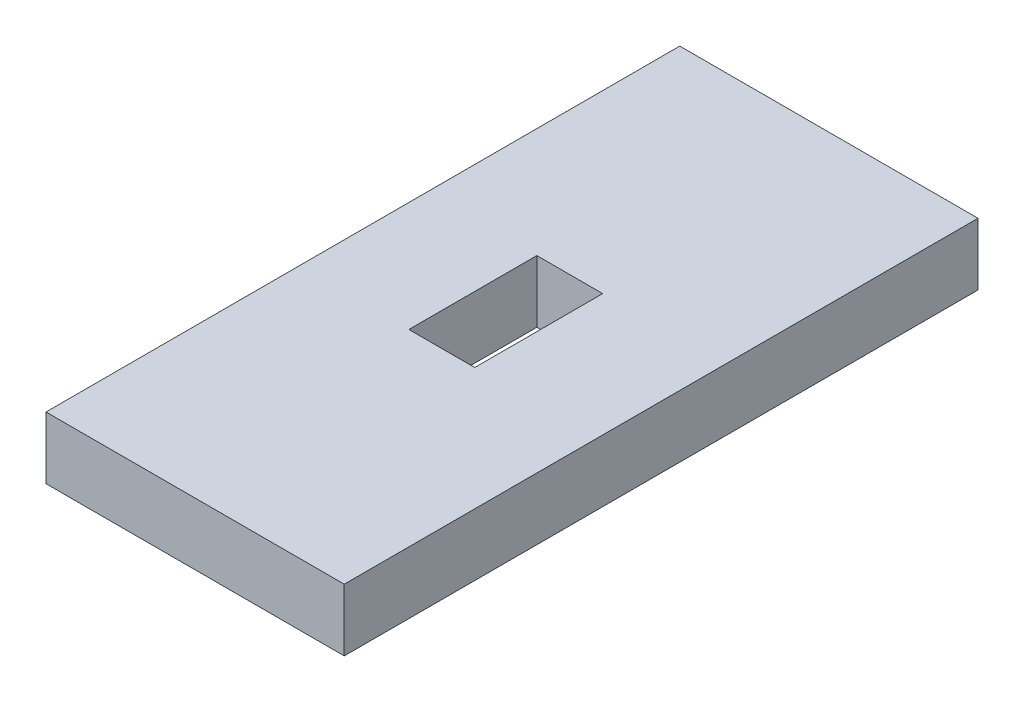
ISO-10303-21;
HEADER;
FILE_DESCRIPTION(('STEP AP214'),'2;1');
FILE_NAME('part.step','',(''),(''),'','','');
FILE_SCHEMA(('AUTOMOTIVE_DESIGN { 1 0 10303 214 1 1 1 1 }'));
ENDSEC;
DATA;
#1=APPLICATION_CONTEXT('core data for automotive mechanical design processes');
#2=APPLICATION_PROTOCOL_DEFINITION('international standard','automotive_design',2000,#1);
#3=PRODUCT_CONTEXT('',#1,'mechanical');
#4=PRODUCT('Part','Part','',(#3));
#5=PRODUCT_RELATED_PRODUCT_CATEGORY('part','',(#4));
#6=PRODUCT_DEFINITION_FORMATION('','',#4);
#7=PRODUCT_DEFINITION_CONTEXT('part definition',#1,'design');
#8=PRODUCT_DEFINITION('design','',#6,#7);
#9=PRODUCT_DEFINITION_SHAPE('','',#8);
#10=(LENGTH_UNIT() NAMED_UNIT(*) SI_UNIT(.MILLI.,.METRE.));
#11=(NAMED_UNIT(*) PLANE_ANGLE_UNIT() SI_UNIT($,.RADIAN.));
#12=(NAMED_UNIT(*) SI_UNIT($,.STERADIAN.) SOLID_ANGLE_UNIT());
#13=UNCERTAINTY_MEASURE_WITH_UNIT(LENGTH_MEASURE(1.E-05),#10,'distance_accuracy_value','');
#14=(GEOMETRIC_REPRESENTATION_CONTEXT(3) GLOBAL_UNCERTAINTY_ASSIGNED_CONTEXT((#13)) GLOBAL_UNIT_ASSIGNED_CONTEXT((#10,
#11,#12)) REPRESENTATION_CONTEXT('',''));
#15=CARTESIAN_POINT('',(0.,0.,0.));
#16=DIRECTION('',(0.,0.,1.));
#17=DIRECTION('',(1.,0.,0.));
#18=AXIS2_PLACEMENT_3D('',#15,#16,#17);
#19=CARTESIAN_POINT('',(0.,5.5,56.));
#20=DIRECTION('',(0.,0.,1.));
#21=DIRECTION('',(-1.,0.,0.));
#22=AXIS2_PLACEMENT_3D('',#19,#20,#21);
#23=PLANE('',#22);
#24=DIRECTION('',(0.,1.,0.));
#25=VECTOR('',#24,1.);
#26=CARTESIAN_POINT('',(-9.00000000000007,5.50000000000014,56.));
#27=LINE('',#26,#25);
#28=CARTESIAN_POINT('',(-9.,0.499999999999879,56.));
#29=VERTEX_POINT('',#28);
#30=CARTESIAN_POINT('',(-9.00000000000007,5.50000000000014,56.));
#31=VERTEX_POINT('',#30);
#32=EDGE_CURVE('E11',#29,#31,#27,.T.);
#33=ORIENTED_EDGE('',*,*,#32,.F.);
#34=DIRECTION('',(1.,0.,0.));
#35=VECTOR('',#34,1.);
#36=CARTESIAN_POINT('',(0.,0.499999999999999,56.));
#37=LINE('',#36,#35);
#38=CARTESIAN_POINT('',(15.,0.500000000000199,56.));
#39=VERTEX_POINT('',#38);
#40=EDGE_CURVE('E112',#39,#29,#37,.F.);
#41=ORIENTED_EDGE('',*,*,#40,.F.);
#42=DIRECTION('',(0.,1.,0.));
#43=VECTOR('',#42,1.);
#44=CARTESIAN_POINT('',(14.9999999999999,5.49999999999979,56.));
#45=LINE('',#44,#43);
#46=CARTESIAN_POINT('',(14.9999999999999,5.49999999999979,56.));
#47=VERTEX_POINT('',#46);
#48=EDGE_CURVE('E55',#39,#47,#45,.T.);
#49=ORIENTED_EDGE('',*,*,#48,.T.);
#50=DIRECTION('',(-1.,0.,0.));
#51=VECTOR('',#50,1.);
#52=CARTESIAN_POINT('',(0.,5.5,56.));
#53=LINE('',#52,#51);
#54=EDGE_CURVE('E148',#47,#31,#53,.T.);
#55=ORIENTED_EDGE('',*,*,#54,.T.);
#56=EDGE_LOOP('',(#33,#41,#49,#55));
#57=FACE_BOUND('',#56,.T.);
#58=ADVANCED_FACE('F45',(#57),#23,.T.);
#59=CARTESIAN_POINT('',(14.9999999999999,5.49999999999979,56.));
#60=DIRECTION('',(-1.,0.,0.));
#61=DIRECTION('',(0.,0.,-1.));
#62=AXIS2_PLACEMENT_3D('',#59,#60,#61);
#63=PLANE('',#62);
#64=ORIENTED_EDGE('',*,*,#48,.F.);
#65=DIRECTION('',(0.,0.,-1.));
#66=VECTOR('',#65,1.);
#67=CARTESIAN_POINT('',(15.,0.500000000000199,56.));
#68=LINE('',#67,#66);
#69=CARTESIAN_POINT('',(15.,0.500000000000199,5.));
#70=VERTEX_POINT('',#69);
#71=EDGE_CURVE('E128',#39,#70,#68,.T.);
#72=ORIENTED_EDGE('',*,*,#71,.T.);
#73=DIRECTION('',(0.,1.,0.));
#74=VECTOR('',#73,1.);
#75=CARTESIAN_POINT('',(14.9999999999999,5.49999999999979,5.));
#76=LINE('',#75,#74);
#77=CARTESIAN_POINT('',(14.9999999999999,5.49999999999979,5.));
#78=VERTEX_POINT('',#77);
#79=EDGE_CURVE('E63',#70,#78,#76,.T.);
#80=ORIENTED_EDGE('',*,*,#79,.T.);
#81=DIRECTION('',(0.,0.,-1.));
#82=VECTOR('',#81,1.);
#83=CARTESIAN_POINT('',(14.9999999999999,5.49999999999979,56.));
#84=LINE('',#83,#82);
#85=EDGE_CURVE('E145',#47,#78,#84,.T.);
#86=ORIENTED_EDGE('',*,*,#85,.F.);
#87=EDGE_LOOP('',(#64,#72,#80,#86));
#88=FACE_BOUND('',#87,.T.);
#89=ADVANCED_FACE('F154',(#88),#63,.F.);
#90=CARTESIAN_POINT('',(0.,5.5,5.));
#91=DIRECTION('',(0.,0.,1.));
#92=DIRECTION('',(-1.,0.,0.));
#93=AXIS2_PLACEMENT_3D('',#90,#91,#92);
#94=PLANE('',#93);
#95=ORIENTED_EDGE('',*,*,#79,.F.);
#96=DIRECTION('',(1.,0.,0.));
#97=VECTOR('',#96,1.);
#98=CARTESIAN_POINT('',(0.,0.499999999999999,5.));
#99=LINE('',#98,#97);
#100=CARTESIAN_POINT('',(-9.,0.499999999999879,5.));
#101=VERTEX_POINT('',#100);
#102=EDGE_CURVE('E111',#70,#101,#99,.F.);
#103=ORIENTED_EDGE('',*,*,#102,.T.);
#104=DIRECTION('',(0.,1.,0.));
#105=VECTOR('',#104,1.);
#106=CARTESIAN_POINT('',(-9.00000000000007,5.50000000000014,5.));
#107=LINE('',#106,#105);
#108=CARTESIAN_POINT('',(-9.00000000000007,5.50000000000014,5.));
#109=VERTEX_POINT('',#108);
#110=EDGE_CURVE('E49',#101,#109,#107,.T.);
#111=ORIENTED_EDGE('',*,*,#110,.T.);
#112=DIRECTION('',(-1.,0.,0.));
#113=VECTOR('',#112,1.);
#114=CARTESIAN_POINT('',(0.,5.5,5.));
#115=LINE('',#114,#113);
#116=EDGE_CURVE('E208',#78,#109,#115,.T.);
#117=ORIENTED_EDGE('',*,*,#116,.F.);
#118=EDGE_LOOP('',(#95,#103,#111,#117));
#119=FACE_BOUND('',#118,.T.);
#120=ADVANCED_FACE('F115',(#119),#94,.F.);
#121=CARTESIAN_POINT('',(-0.150000000000074,5.5,25.35));
#122=DIRECTION('',(0.,0.,1.));
#123=DIRECTION('',(-1.,0.,0.));
#124=AXIS2_PLACEMENT_3D('',#121,#122,#123);
#125=PLANE('',#124);
#126=DIRECTION('',(0.,1.,0.));
#127=VECTOR('',#126,1.);
#128=CARTESIAN_POINT('',(-0.150000000000074,5.5,25.35));
#129=LINE('',#128,#127);
#130=CARTESIAN_POINT('',(-0.150000000000008,0.499999999999997,25.35));
#131=VERTEX_POINT('',#130);
#132=CARTESIAN_POINT('',(-0.150000000000074,5.5,25.35));
#133=VERTEX_POINT('',#132);
#134=EDGE_CURVE('E106',#131,#133,#129,.T.);
#135=ORIENTED_EDGE('',*,*,#134,.F.);
#136=DIRECTION('',(1.,0.,0.));
#137=VECTOR('',#136,1.);
#138=CARTESIAN_POINT('',(0.,0.499999999999999,25.35));
#139=LINE('',#138,#137);
#140=CARTESIAN_POINT('',(5.14999999999996,0.500000000000067,25.35));
#141=VERTEX_POINT('',#140);
#142=EDGE_CURVE('E122',#141,#131,#139,.F.);
#143=ORIENTED_EDGE('',*,*,#142,.F.);
#144=DIRECTION('',(0.,1.,0.));
#145=VECTOR('',#144,1.);
#146=CARTESIAN_POINT('',(5.1499999999999,5.49999999999993,25.35));
#147=LINE('',#146,#145);
#148=CARTESIAN_POINT('',(5.1499999999999,5.49999999999993,25.35));
#149=VERTEX_POINT('',#148);
#150=EDGE_CURVE('E137',#141,#149,#147,.T.);
#151=ORIENTED_EDGE('',*,*,#150,.T.);
#152=DIRECTION('',(-1.,0.,0.));
#153=VECTOR('',#152,1.);
#154=CARTESIAN_POINT('',(-0.150000000000074,5.5,25.35));
#155=LINE('',#154,#153);
#156=EDGE_CURVE('E200',#149,#133,#155,.T.);
#157=ORIENTED_EDGE('',*,*,#156,.T.);
#158=EDGE_LOOP('',(#135,#143,#151,#157));
#159=FACE_BOUND('',#158,.T.);
#160=ADVANCED_FACE('F203',(#159),#125,.T.);
#161=CARTESIAN_POINT('',(5.1499999999999,5.49999999999993,25.35));
#162=DIRECTION('',(-1.,0.,0.));
#163=DIRECTION('',(0.,0.,-1.));
#164=AXIS2_PLACEMENT_3D('',#161,#162,#163);
#165=PLANE('',#164);
#166=ORIENTED_EDGE('',*,*,#150,.F.);
#167=DIRECTION('',(0.,0.,-1.));
#168=VECTOR('',#167,1.);
#169=CARTESIAN_POINT('',(5.15,0.500000000000067,56.));
#170=LINE('',#169,#168);
#171=CARTESIAN_POINT('',(5.15,0.500000000000067,35.65));
#172=VERTEX_POINT('',#171);
#173=EDGE_CURVE('E117',#172,#141,#170,.T.);
#174=ORIENTED_EDGE('',*,*,#173,.F.);
#175=DIRECTION('',(0.,1.,0.));
#176=VECTOR('',#175,1.);
#177=CARTESIAN_POINT('',(5.14999999999993,5.49999999999993,35.65));
#178=LINE('',#177,#176);
#179=CARTESIAN_POINT('',(5.14999999999993,5.49999999999993,35.65));
#180=VERTEX_POINT('',#179);
#181=EDGE_CURVE('E134',#172,#180,#178,.T.);
#182=ORIENTED_EDGE('',*,*,#181,.T.);
#183=DIRECTION('',(0.,0.,-1.));
#184=VECTOR('',#183,1.);
#185=CARTESIAN_POINT('',(5.1499999999999,5.49999999999993,25.35));
#186=LINE('',#185,#184);
#187=EDGE_CURVE('E185',#180,#149,#186,.T.);
#188=ORIENTED_EDGE('',*,*,#187,.T.);
#189=EDGE_LOOP('',(#166,#174,#182,#188));
#190=FACE_BOUND('',#189,.T.);
#191=ADVANCED_FACE('F183',(#190),#165,.T.);
#192=CARTESIAN_POINT('',(-0.150000000000073,5.5,35.65));
#193=DIRECTION('',(0.,0.,-1.));
#194=DIRECTION('',(1.,0.,0.));
#195=AXIS2_PLACEMENT_3D('',#192,#193,#194);
#196=PLANE('',#195);
#197=ORIENTED_EDGE('',*,*,#181,.F.);
#198=DIRECTION('',(1.,0.,0.));
#199=VECTOR('',#198,1.);
#200=CARTESIAN_POINT('',(0.,0.499999999999999,35.65));
#201=LINE('',#200,#199);
#202=CARTESIAN_POINT('',(-0.150000000000007,0.499999999999997,35.65));
#203=VERTEX_POINT('',#202);
#204=EDGE_CURVE('E160',#203,#172,#201,.T.);
#205=ORIENTED_EDGE('',*,*,#204,.F.);
#206=DIRECTION('',(0.,1.,0.));
#207=VECTOR('',#206,1.);
#208=CARTESIAN_POINT('',(-0.150000000000073,5.5,35.65));
#209=LINE('',#208,#207);
#210=CARTESIAN_POINT('',(-0.150000000000073,5.5,35.65));
#211=VERTEX_POINT('',#210);
#212=EDGE_CURVE('E138',#203,#211,#209,.T.);
#213=ORIENTED_EDGE('',*,*,#212,.T.);
#214=DIRECTION('',(1.,0.,0.));
#215=VECTOR('',#214,1.);
#216=CARTESIAN_POINT('',(-0.150000000000073,5.5,35.65));
#217=LINE('',#216,#215);
#218=EDGE_CURVE('E131',#211,#180,#217,.T.);
#219=ORIENTED_EDGE('',*,*,#218,.T.);
#220=EDGE_LOOP('',(#197,#205,#213,#219));
#221=FACE_BOUND('',#220,.T.);
#222=ADVANCED_FACE('F176',(#221),#196,.T.);
#223=CARTESIAN_POINT('',(-0.150000000000074,5.5,25.35));
#224=DIRECTION('',(1.,0.,0.));
#225=DIRECTION('',(0.,0.,1.));
#226=AXIS2_PLACEMENT_3D('',#223,#224,#225);
#227=PLANE('',#226);
#228=DIRECTION('',(0.,0.,-1.));
#229=VECTOR('',#228,1.);
#230=CARTESIAN_POINT('',(-0.150000000000008,0.499999999999997,56.));
#231=LINE('',#230,#229);
#232=EDGE_CURVE('E126',#131,#203,#231,.F.);
#233=ORIENTED_EDGE('',*,*,#232,.F.);
#234=ORIENTED_EDGE('',*,*,#134,.T.);
#235=DIRECTION('',(0.,0.,1.));
#236=VECTOR('',#235,1.);
#237=CARTESIAN_POINT('',(-0.150000000000074,5.5,25.35));
#238=LINE('',#237,#236);
#239=EDGE_CURVE('E195',#133,#211,#238,.T.);
#240=ORIENTED_EDGE('',*,*,#239,.T.);
#241=ORIENTED_EDGE('',*,*,#212,.F.);
#242=EDGE_LOOP('',(#233,#234,#240,#241));
#243=FACE_BOUND('',#242,.T.);
#244=ADVANCED_FACE('F194',(#243),#227,.T.);
#245=CARTESIAN_POINT('',(-9.00000000000007,5.50000000000014,56.));
#246=DIRECTION('',(-1.,0.,0.));
#247=DIRECTION('',(0.,0.,-1.));
#248=AXIS2_PLACEMENT_3D('',#245,#246,#247);
#249=PLANE('',#248);
#250=DIRECTION('',(0.,0.,-1.));
#251=VECTOR('',#250,1.);
#252=CARTESIAN_POINT('',(-9.,0.499999999999879,56.));
#253=LINE('',#252,#251);
#254=EDGE_CURVE('E99',#29,#101,#253,.T.);
#255=ORIENTED_EDGE('',*,*,#254,.F.);
#256=ORIENTED_EDGE('',*,*,#32,.T.);
#257=DIRECTION('',(0.,0.,-1.));
#258=VECTOR('',#257,1.);
#259=CARTESIAN_POINT('',(-9.00000000000007,5.50000000000014,56.));
#260=LINE('',#259,#258);
#261=EDGE_CURVE('E102',#31,#109,#260,.T.);
#262=ORIENTED_EDGE('',*,*,#261,.T.);
#263=ORIENTED_EDGE('',*,*,#110,.F.);
#264=EDGE_LOOP('',(#255,#256,#262,#263));
#265=FACE_BOUND('',#264,.T.);
#266=ADVANCED_FACE('F47',(#265),#249,.T.);
#267=CARTESIAN_POINT('',(0.,5.5,56.));
#268=DIRECTION('',(0.,-1.,0.));
#269=DIRECTION('',(0.,0.,-1.));
#270=AXIS2_PLACEMENT_3D('',#267,#268,#269);
#271=PLANE('',#270);
#272=ORIENTED_EDGE('',*,*,#218,.F.);
#273=ORIENTED_EDGE('',*,*,#239,.F.);
#274=ORIENTED_EDGE('',*,*,#156,.F.);
#275=ORIENTED_EDGE('',*,*,#187,.F.);
#276=EDGE_LOOP('',(#272,#273,#274,#275));
#277=FACE_BOUND('',#276,.T.);
#278=ORIENTED_EDGE('',*,*,#116,.T.);
#279=ORIENTED_EDGE('',*,*,#261,.F.);
#280=ORIENTED_EDGE('',*,*,#54,.F.);
#281=ORIENTED_EDGE('',*,*,#85,.T.);
#282=EDGE_LOOP('',(#278,#279,#280,#281));
#283=FACE_BOUND('',#282,.T.);
#284=ADVANCED_FACE('F151',(#277,#283),#271,.F.);
#285=CARTESIAN_POINT('',(0.,0.499999999999999,56.));
#286=DIRECTION('',(0.,-1.,0.));
#287=DIRECTION('',(0.,0.,-1.));
#288=AXIS2_PLACEMENT_3D('',#285,#286,#287);
#289=PLANE('',#288);
#290=ORIENTED_EDGE('',*,*,#204,.T.);
#291=ORIENTED_EDGE('',*,*,#173,.T.);
#292=ORIENTED_EDGE('',*,*,#142,.T.);
#293=ORIENTED_EDGE('',*,*,#232,.T.);
#294=EDGE_LOOP('',(#290,#291,#292,#293));
#295=FACE_BOUND('',#294,.T.);
#296=ORIENTED_EDGE('',*,*,#102,.F.);
#297=ORIENTED_EDGE('',*,*,#71,.F.);
#298=ORIENTED_EDGE('',*,*,#40,.T.);
#299=ORIENTED_EDGE('',*,*,#254,.T.);
#300=EDGE_LOOP('',(#296,#297,#298,#299));
#301=FACE_BOUND('',#300,.T.);
#302=ADVANCED_FACE('F109',(#295,#301),#289,.T.);
#303=CLOSED_SHELL('',(#58,#89,#120,#160,#191,#222,#244,#266,#284,#302));
#304=MANIFOLD_SOLID_BREP('B2',#303);
#305=ADVANCED_BREP_SHAPE_REPRESENTATION('',(#18,#304),#14);
#306=SHAPE_DEFINITION_REPRESENTATION(#9,#305);
ENDSEC;
END-ISO-10303-21;
